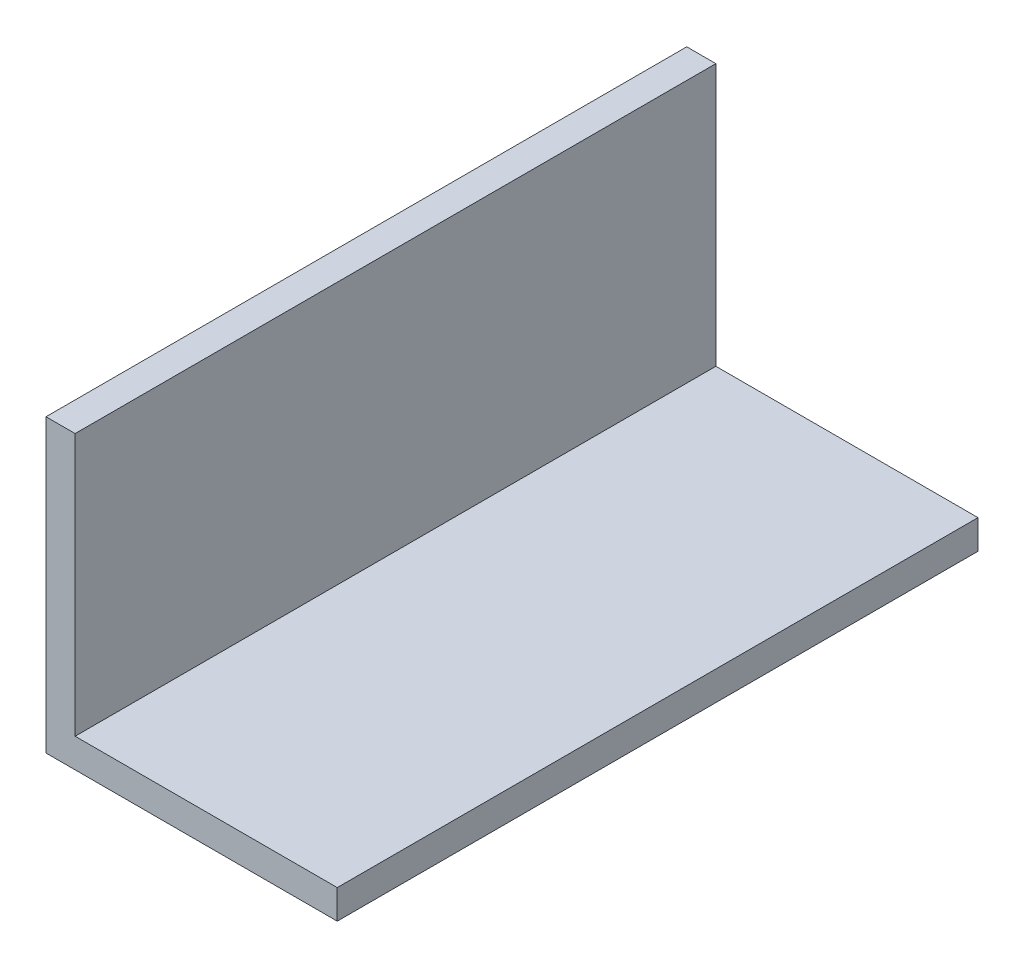
ISO-10303-21;
HEADER;
FILE_DESCRIPTION(('STEP AP214'),'2;1');
FILE_NAME('part.step','',(''),(''),'','','');
FILE_SCHEMA(('AUTOMOTIVE_DESIGN { 1 0 10303 214 1 1 1 1 }'));
ENDSEC;
DATA;
#1=APPLICATION_CONTEXT('core data for automotive mechanical design processes');
#2=APPLICATION_PROTOCOL_DEFINITION('international standard','automotive_design',2000,#1);
#3=PRODUCT_CONTEXT('',#1,'mechanical');
#4=PRODUCT('Part','Part','',(#3));
#5=PRODUCT_RELATED_PRODUCT_CATEGORY('part','',(#4));
#6=PRODUCT_DEFINITION_FORMATION('','',#4);
#7=PRODUCT_DEFINITION_CONTEXT('part definition',#1,'design');
#8=PRODUCT_DEFINITION('design','',#6,#7);
#9=PRODUCT_DEFINITION_SHAPE('','',#8);
#10=(LENGTH_UNIT() NAMED_UNIT(*) SI_UNIT(.MILLI.,.METRE.));
#11=(NAMED_UNIT(*) PLANE_ANGLE_UNIT() SI_UNIT($,.RADIAN.));
#12=(NAMED_UNIT(*) SI_UNIT($,.STERADIAN.) SOLID_ANGLE_UNIT());
#13=UNCERTAINTY_MEASURE_WITH_UNIT(LENGTH_MEASURE(1.E-05),#10,'distance_accuracy_value','');
#14=(GEOMETRIC_REPRESENTATION_CONTEXT(3) GLOBAL_UNCERTAINTY_ASSIGNED_CONTEXT((#13)) GLOBAL_UNIT_ASSIGNED_CONTEXT((#10,
#11,#12)) REPRESENTATION_CONTEXT('',''));
#15=CARTESIAN_POINT('',(0.,0.,0.));
#16=DIRECTION('',(0.,0.,1.));
#17=DIRECTION('',(1.,0.,0.));
#18=AXIS2_PLACEMENT_3D('',#15,#16,#17);
#19=CARTESIAN_POINT('',(0.,30.,66.));
#20=DIRECTION('',(0.,-1.,0.));
#21=DIRECTION('',(0.,0.,-1.));
#22=AXIS2_PLACEMENT_3D('',#19,#20,#21);
#23=PLANE('',#22);
#24=DIRECTION('',(-1.,0.,0.));
#25=VECTOR('',#24,1.);
#26=CARTESIAN_POINT('',(0.,30.,0.));
#27=LINE('',#26,#25);
#28=CARTESIAN_POINT('',(3.,30.,0.));
#29=VERTEX_POINT('',#28);
#30=CARTESIAN_POINT('',(0.,30.,0.));
#31=VERTEX_POINT('',#30);
#32=EDGE_CURVE('E119',#29,#31,#27,.T.);
#33=ORIENTED_EDGE('',*,*,#32,.T.);
#34=DIRECTION('',(0.,0.,-1.));
#35=VECTOR('',#34,1.);
#36=CARTESIAN_POINT('',(0.,30.,66.));
#37=LINE('',#36,#35);
#38=CARTESIAN_POINT('',(0.,30.,66.));
#39=VERTEX_POINT('',#38);
#40=EDGE_CURVE('E11',#39,#31,#37,.T.);
#41=ORIENTED_EDGE('',*,*,#40,.F.);
#42=DIRECTION('',(-1.,0.,0.));
#43=VECTOR('',#42,1.);
#44=CARTESIAN_POINT('',(0.,30.,66.));
#45=LINE('',#44,#43);
#46=CARTESIAN_POINT('',(3.,30.,66.));
#47=VERTEX_POINT('',#46);
#48=EDGE_CURVE('E129',#47,#39,#45,.T.);
#49=ORIENTED_EDGE('',*,*,#48,.F.);
#50=DIRECTION('',(0.,0.,-1.));
#51=VECTOR('',#50,1.);
#52=CARTESIAN_POINT('',(3.,30.,66.));
#53=LINE('',#52,#51);
#54=EDGE_CURVE('E115',#47,#29,#53,.T.);
#55=ORIENTED_EDGE('',*,*,#54,.T.);
#56=EDGE_LOOP('',(#33,#41,#49,#55));
#57=FACE_BOUND('',#56,.T.);
#58=ADVANCED_FACE('F35',(#57),#23,.F.);
#59=CARTESIAN_POINT('',(0.,30.,66.));
#60=DIRECTION('',(1.,0.,0.));
#61=DIRECTION('',(0.,1.,0.));
#62=AXIS2_PLACEMENT_3D('',#59,#60,#61);
#63=PLANE('',#62);
#64=DIRECTION('',(0.,-1.,0.));
#65=VECTOR('',#64,1.);
#66=CARTESIAN_POINT('',(0.,30.,0.));
#67=LINE('',#66,#65);
#68=CARTESIAN_POINT('',(0.,0.,0.));
#69=VERTEX_POINT('',#68);
#70=EDGE_CURVE('E122',#31,#69,#67,.T.);
#71=ORIENTED_EDGE('',*,*,#70,.T.);
#72=DIRECTION('',(0.,0.,-1.));
#73=VECTOR('',#72,1.);
#74=CARTESIAN_POINT('',(0.,0.,66.));
#75=LINE('',#74,#73);
#76=CARTESIAN_POINT('',(0.,0.,66.));
#77=VERTEX_POINT('',#76);
#78=EDGE_CURVE('E43',#77,#69,#75,.T.);
#79=ORIENTED_EDGE('',*,*,#78,.F.);
#80=DIRECTION('',(0.,-1.,0.));
#81=VECTOR('',#80,1.);
#82=CARTESIAN_POINT('',(0.,30.,66.));
#83=LINE('',#82,#81);
#84=EDGE_CURVE('E88',#39,#77,#83,.T.);
#85=ORIENTED_EDGE('',*,*,#84,.F.);
#86=ORIENTED_EDGE('',*,*,#40,.T.);
#87=EDGE_LOOP('',(#71,#79,#85,#86));
#88=FACE_BOUND('',#87,.T.);
#89=ADVANCED_FACE('F153',(#88),#63,.F.);
#90=CARTESIAN_POINT('',(0.,0.,66.));
#91=DIRECTION('',(0.,1.,0.));
#92=DIRECTION('',(0.,0.,1.));
#93=AXIS2_PLACEMENT_3D('',#90,#91,#92);
#94=PLANE('',#93);
#95=DIRECTION('',(1.,0.,0.));
#96=VECTOR('',#95,1.);
#97=CARTESIAN_POINT('',(0.,0.,0.));
#98=LINE('',#97,#96);
#99=CARTESIAN_POINT('',(30.,0.,0.));
#100=VERTEX_POINT('',#99);
#101=EDGE_CURVE('E124',#69,#100,#98,.T.);
#102=ORIENTED_EDGE('',*,*,#101,.T.);
#103=DIRECTION('',(0.,0.,-1.));
#104=VECTOR('',#103,1.);
#105=CARTESIAN_POINT('',(30.,0.,66.));
#106=LINE('',#105,#104);
#107=CARTESIAN_POINT('',(30.,0.,66.));
#108=VERTEX_POINT('',#107);
#109=EDGE_CURVE('E110',#108,#100,#106,.T.);
#110=ORIENTED_EDGE('',*,*,#109,.F.);
#111=DIRECTION('',(1.,0.,0.));
#112=VECTOR('',#111,1.);
#113=CARTESIAN_POINT('',(0.,0.,66.));
#114=LINE('',#113,#112);
#115=EDGE_CURVE('E101',#77,#108,#114,.T.);
#116=ORIENTED_EDGE('',*,*,#115,.F.);
#117=ORIENTED_EDGE('',*,*,#78,.T.);
#118=EDGE_LOOP('',(#102,#110,#116,#117));
#119=FACE_BOUND('',#118,.T.);
#120=ADVANCED_FACE('F135',(#119),#94,.F.);
#121=CARTESIAN_POINT('',(30.,3.,66.));
#122=DIRECTION('',(-1.,0.,0.));
#123=DIRECTION('',(0.,0.,1.));
#124=AXIS2_PLACEMENT_3D('',#121,#122,#123);
#125=PLANE('',#124);
#126=DIRECTION('',(0.,1.,0.));
#127=VECTOR('',#126,1.);
#128=CARTESIAN_POINT('',(30.,3.,0.));
#129=LINE('',#128,#127);
#130=CARTESIAN_POINT('',(30.,3.,0.));
#131=VERTEX_POINT('',#130);
#132=EDGE_CURVE('E109',#100,#131,#129,.T.);
#133=ORIENTED_EDGE('',*,*,#132,.T.);
#134=DIRECTION('',(0.,0.,-1.));
#135=VECTOR('',#134,1.);
#136=CARTESIAN_POINT('',(30.,3.,66.));
#137=LINE('',#136,#135);
#138=CARTESIAN_POINT('',(30.,3.,66.));
#139=VERTEX_POINT('',#138);
#140=EDGE_CURVE('E106',#139,#131,#137,.T.);
#141=ORIENTED_EDGE('',*,*,#140,.F.);
#142=DIRECTION('',(0.,1.,0.));
#143=VECTOR('',#142,1.);
#144=CARTESIAN_POINT('',(30.,3.,66.));
#145=LINE('',#144,#143);
#146=EDGE_CURVE('E95',#108,#139,#145,.T.);
#147=ORIENTED_EDGE('',*,*,#146,.F.);
#148=ORIENTED_EDGE('',*,*,#109,.T.);
#149=EDGE_LOOP('',(#133,#141,#147,#148));
#150=FACE_BOUND('',#149,.T.);
#151=ADVANCED_FACE('F107',(#150),#125,.F.);
#152=CARTESIAN_POINT('',(3.,3.,66.));
#153=DIRECTION('',(0.,-1.,0.));
#154=DIRECTION('',(0.,0.,-1.));
#155=AXIS2_PLACEMENT_3D('',#152,#153,#154);
#156=PLANE('',#155);
#157=DIRECTION('',(-1.,0.,0.));
#158=VECTOR('',#157,1.);
#159=CARTESIAN_POINT('',(3.,3.,0.));
#160=LINE('',#159,#158);
#161=CARTESIAN_POINT('',(3.,3.,0.));
#162=VERTEX_POINT('',#161);
#163=EDGE_CURVE('E74',#131,#162,#160,.T.);
#164=ORIENTED_EDGE('',*,*,#163,.T.);
#165=DIRECTION('',(0.,0.,-1.));
#166=VECTOR('',#165,1.);
#167=CARTESIAN_POINT('',(3.,3.,66.));
#168=LINE('',#167,#166);
#169=CARTESIAN_POINT('',(3.,3.,66.));
#170=VERTEX_POINT('',#169);
#171=EDGE_CURVE('E111',#170,#162,#168,.T.);
#172=ORIENTED_EDGE('',*,*,#171,.F.);
#173=DIRECTION('',(-1.,0.,0.));
#174=VECTOR('',#173,1.);
#175=CARTESIAN_POINT('',(3.,3.,66.));
#176=LINE('',#175,#174);
#177=EDGE_CURVE('E99',#139,#170,#176,.T.);
#178=ORIENTED_EDGE('',*,*,#177,.F.);
#179=ORIENTED_EDGE('',*,*,#140,.T.);
#180=EDGE_LOOP('',(#164,#172,#178,#179));
#181=FACE_BOUND('',#180,.T.);
#182=ADVANCED_FACE('F113',(#181),#156,.F.);
#183=CARTESIAN_POINT('',(3.,30.,66.));
#184=DIRECTION('',(-1.,0.,0.));
#185=DIRECTION('',(0.,-1.,0.));
#186=AXIS2_PLACEMENT_3D('',#183,#184,#185);
#187=PLANE('',#186);
#188=DIRECTION('',(0.,1.,0.));
#189=VECTOR('',#188,1.);
#190=CARTESIAN_POINT('',(3.,30.,0.));
#191=LINE('',#190,#189);
#192=EDGE_CURVE('E80',#162,#29,#191,.T.);
#193=ORIENTED_EDGE('',*,*,#192,.T.);
#194=ORIENTED_EDGE('',*,*,#54,.F.);
#195=DIRECTION('',(0.,1.,0.));
#196=VECTOR('',#195,1.);
#197=CARTESIAN_POINT('',(3.,30.,66.));
#198=LINE('',#197,#196);
#199=EDGE_CURVE('E51',#170,#47,#198,.T.);
#200=ORIENTED_EDGE('',*,*,#199,.F.);
#201=ORIENTED_EDGE('',*,*,#171,.T.);
#202=EDGE_LOOP('',(#193,#194,#200,#201));
#203=FACE_BOUND('',#202,.T.);
#204=ADVANCED_FACE('F142',(#203),#187,.F.);
#205=CARTESIAN_POINT('',(0.,0.,66.));
#206=DIRECTION('',(0.,0.,-1.));
#207=DIRECTION('',(-1.,0.,0.));
#208=AXIS2_PLACEMENT_3D('',#205,#206,#207);
#209=PLANE('',#208);
#210=ORIENTED_EDGE('',*,*,#48,.T.);
#211=ORIENTED_EDGE('',*,*,#84,.T.);
#212=ORIENTED_EDGE('',*,*,#115,.T.);
#213=ORIENTED_EDGE('',*,*,#146,.T.);
#214=ORIENTED_EDGE('',*,*,#177,.T.);
#215=ORIENTED_EDGE('',*,*,#199,.T.);
#216=EDGE_LOOP('',(#210,#211,#212,#213,#214,#215));
#217=FACE_BOUND('',#216,.T.);
#218=ADVANCED_FACE('F97',(#217),#209,.F.);
#219=CARTESIAN_POINT('',(0.,0.,0.));
#220=DIRECTION('',(0.,0.,-1.));
#221=DIRECTION('',(-1.,0.,0.));
#222=AXIS2_PLACEMENT_3D('',#219,#220,#221);
#223=PLANE('',#222);
#224=ORIENTED_EDGE('',*,*,#32,.F.);
#225=ORIENTED_EDGE('',*,*,#192,.F.);
#226=ORIENTED_EDGE('',*,*,#163,.F.);
#227=ORIENTED_EDGE('',*,*,#132,.F.);
#228=ORIENTED_EDGE('',*,*,#101,.F.);
#229=ORIENTED_EDGE('',*,*,#70,.F.);
#230=EDGE_LOOP('',(#224,#225,#226,#227,#228,#229));
#231=FACE_BOUND('',#230,.T.);
#232=ADVANCED_FACE('F138',(#231),#223,.T.);
#233=CLOSED_SHELL('',(#58,#89,#120,#151,#182,#204,#218,#232));
#234=MANIFOLD_SOLID_BREP('B2',#233);
#235=ADVANCED_BREP_SHAPE_REPRESENTATION('',(#18,#234),#14);
#236=SHAPE_DEFINITION_REPRESENTATION(#9,#235);
ENDSEC;
END-ISO-10303-21;
